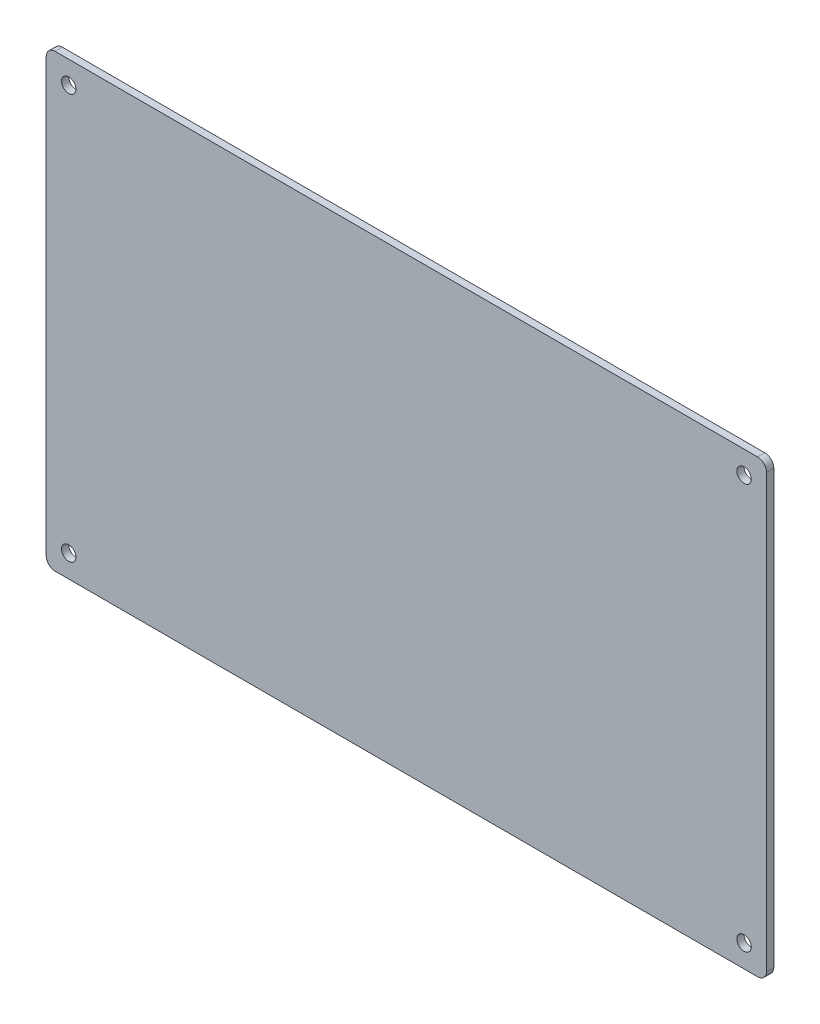
ISO-10303-21;
HEADER;
FILE_DESCRIPTION(('STEP AP214'),'2;1');
FILE_NAME('part.step','',(''),(''),'','','');
FILE_SCHEMA(('AUTOMOTIVE_DESIGN { 1 0 10303 214 1 1 1 1 }'));
ENDSEC;
DATA;
#1=APPLICATION_CONTEXT('core data for automotive mechanical design processes');
#2=APPLICATION_PROTOCOL_DEFINITION('international standard','automotive_design',2000,#1);
#3=PRODUCT_CONTEXT('',#1,'mechanical');
#4=PRODUCT('Part','Part','',(#3));
#5=PRODUCT_RELATED_PRODUCT_CATEGORY('part','',(#4));
#6=PRODUCT_DEFINITION_FORMATION('','',#4);
#7=PRODUCT_DEFINITION_CONTEXT('part definition',#1,'design');
#8=PRODUCT_DEFINITION('design','',#6,#7);
#9=PRODUCT_DEFINITION_SHAPE('','',#8);
#10=(LENGTH_UNIT() NAMED_UNIT(*) SI_UNIT(.MILLI.,.METRE.));
#11=(NAMED_UNIT(*) PLANE_ANGLE_UNIT() SI_UNIT($,.RADIAN.));
#12=(NAMED_UNIT(*) SI_UNIT($,.STERADIAN.) SOLID_ANGLE_UNIT());
#13=UNCERTAINTY_MEASURE_WITH_UNIT(LENGTH_MEASURE(1.E-05),#10,'distance_accuracy_value','');
#14=(GEOMETRIC_REPRESENTATION_CONTEXT(3) GLOBAL_UNCERTAINTY_ASSIGNED_CONTEXT((#13)) GLOBAL_UNIT_ASSIGNED_CONTEXT((#10,
#11,#12)) REPRESENTATION_CONTEXT('',''));
#15=CARTESIAN_POINT('',(0.,0.,0.));
#16=DIRECTION('',(0.,0.,1.));
#17=DIRECTION('',(1.,0.,0.));
#18=AXIS2_PLACEMENT_3D('',#15,#16,#17);
#19=CARTESIAN_POINT('',(-80.,-50.,1.6));
#20=DIRECTION('',(1.,0.,0.));
#21=DIRECTION('',(0.,0.,-1.));
#22=AXIS2_PLACEMENT_3D('',#19,#20,#21);
#23=PLANE('',#22);
#24=DIRECTION('',(0.,-1.,0.));
#25=VECTOR('',#24,1.);
#26=CARTESIAN_POINT('',(-80.,-50.,1.6));
#27=LINE('',#26,#25);
#28=CARTESIAN_POINT('',(-80.,48.,1.6));
#29=VERTEX_POINT('',#28);
#30=CARTESIAN_POINT('',(-80.,-48.,1.6));
#31=VERTEX_POINT('',#30);
#32=EDGE_CURVE('E124',#29,#31,#27,.T.);
#33=ORIENTED_EDGE('',*,*,#32,.F.);
#34=DIRECTION('',(0.,0.,-1.));
#35=VECTOR('',#34,1.);
#36=CARTESIAN_POINT('',(-80.,48.,1.6));
#37=LINE('',#36,#35);
#38=CARTESIAN_POINT('',(-80.,48.,0.));
#39=VERTEX_POINT('',#38);
#40=EDGE_CURVE('E109',#29,#39,#37,.T.);
#41=ORIENTED_EDGE('',*,*,#40,.T.);
#42=DIRECTION('',(0.,-1.,0.));
#43=VECTOR('',#42,1.);
#44=CARTESIAN_POINT('',(-80.,-50.,0.));
#45=LINE('',#44,#43);
#46=CARTESIAN_POINT('',(-80.,-48.,0.));
#47=VERTEX_POINT('',#46);
#48=EDGE_CURVE('E121',#39,#47,#45,.T.);
#49=ORIENTED_EDGE('',*,*,#48,.T.);
#50=DIRECTION('',(0.,0.,-1.));
#51=VECTOR('',#50,1.);
#52=CARTESIAN_POINT('',(-80.,-48.,1.6));
#53=LINE('',#52,#51);
#54=EDGE_CURVE('E126',#47,#31,#53,.F.);
#55=ORIENTED_EDGE('',*,*,#54,.T.);
#56=EDGE_LOOP('',(#33,#41,#49,#55));
#57=FACE_BOUND('',#56,.T.);
#58=ADVANCED_FACE('F37',(#57),#23,.F.);
#59=CARTESIAN_POINT('',(80.,-50.,1.6));
#60=DIRECTION('',(0.,1.,0.));
#61=DIRECTION('',(-1.,0.,0.));
#62=AXIS2_PLACEMENT_3D('',#59,#60,#61);
#63=PLANE('',#62);
#64=DIRECTION('',(1.,0.,0.));
#65=VECTOR('',#64,1.);
#66=CARTESIAN_POINT('',(80.,-50.,1.6));
#67=LINE('',#66,#65);
#68=CARTESIAN_POINT('',(-78.,-50.,1.6));
#69=VERTEX_POINT('',#68);
#70=CARTESIAN_POINT('',(78.,-50.,1.6));
#71=VERTEX_POINT('',#70);
#72=EDGE_CURVE('E184',#69,#71,#67,.T.);
#73=ORIENTED_EDGE('',*,*,#72,.F.);
#74=DIRECTION('',(0.,0.,-1.));
#75=VECTOR('',#74,1.);
#76=CARTESIAN_POINT('',(-78.,-50.,1.6));
#77=LINE('',#76,#75);
#78=CARTESIAN_POINT('',(-78.,-50.,0.));
#79=VERTEX_POINT('',#78);
#80=EDGE_CURVE('E163',#69,#79,#77,.T.);
#81=ORIENTED_EDGE('',*,*,#80,.T.);
#82=DIRECTION('',(1.,0.,0.));
#83=VECTOR('',#82,1.);
#84=CARTESIAN_POINT('',(80.,-50.,0.));
#85=LINE('',#84,#83);
#86=CARTESIAN_POINT('',(78.,-50.,0.));
#87=VERTEX_POINT('',#86);
#88=EDGE_CURVE('E130',#79,#87,#85,.T.);
#89=ORIENTED_EDGE('',*,*,#88,.T.);
#90=DIRECTION('',(0.,0.,-1.));
#91=VECTOR('',#90,1.);
#92=CARTESIAN_POINT('',(78.,-50.,1.6));
#93=LINE('',#92,#91);
#94=EDGE_CURVE('E161',#87,#71,#93,.F.);
#95=ORIENTED_EDGE('',*,*,#94,.T.);
#96=EDGE_LOOP('',(#73,#81,#89,#95));
#97=FACE_BOUND('',#96,.T.);
#98=ADVANCED_FACE('F202',(#97),#63,.F.);
#99=CARTESIAN_POINT('',(80.,-50.,1.6));
#100=DIRECTION('',(-1.,0.,0.));
#101=DIRECTION('',(0.,0.,1.));
#102=AXIS2_PLACEMENT_3D('',#99,#100,#101);
#103=PLANE('',#102);
#104=DIRECTION('',(0.,1.,0.));
#105=VECTOR('',#104,1.);
#106=CARTESIAN_POINT('',(80.,-50.,1.6));
#107=LINE('',#106,#105);
#108=CARTESIAN_POINT('',(80.,-48.,1.6));
#109=VERTEX_POINT('',#108);
#110=CARTESIAN_POINT('',(80.,48.,1.6));
#111=VERTEX_POINT('',#110);
#112=EDGE_CURVE('E185',#109,#111,#107,.T.);
#113=ORIENTED_EDGE('',*,*,#112,.F.);
#114=DIRECTION('',(0.,0.,-1.));
#115=VECTOR('',#114,1.);
#116=CARTESIAN_POINT('',(80.,-48.,1.6));
#117=LINE('',#116,#115);
#118=CARTESIAN_POINT('',(80.,-48.,0.));
#119=VERTEX_POINT('',#118);
#120=EDGE_CURVE('E11',#109,#119,#117,.T.);
#121=ORIENTED_EDGE('',*,*,#120,.T.);
#122=DIRECTION('',(0.,1.,0.));
#123=VECTOR('',#122,1.);
#124=CARTESIAN_POINT('',(80.,-50.,0.));
#125=LINE('',#124,#123);
#126=CARTESIAN_POINT('',(80.,48.,0.));
#127=VERTEX_POINT('',#126);
#128=EDGE_CURVE('E134',#119,#127,#125,.T.);
#129=ORIENTED_EDGE('',*,*,#128,.T.);
#130=DIRECTION('',(0.,0.,-1.));
#131=VECTOR('',#130,1.);
#132=CARTESIAN_POINT('',(80.,48.,1.6));
#133=LINE('',#132,#131);
#134=EDGE_CURVE('E46',#127,#111,#133,.F.);
#135=ORIENTED_EDGE('',*,*,#134,.T.);
#136=EDGE_LOOP('',(#113,#121,#129,#135));
#137=FACE_BOUND('',#136,.T.);
#138=ADVANCED_FACE('F195',(#137),#103,.F.);
#139=CARTESIAN_POINT('',(80.,50.,1.6));
#140=DIRECTION('',(0.,-1.,0.));
#141=DIRECTION('',(1.,0.,0.));
#142=AXIS2_PLACEMENT_3D('',#139,#140,#141);
#143=PLANE('',#142);
#144=DIRECTION('',(-1.,0.,0.));
#145=VECTOR('',#144,1.);
#146=CARTESIAN_POINT('',(80.,50.,0.));
#147=LINE('',#146,#145);
#148=CARTESIAN_POINT('',(78.,50.,0.));
#149=VERTEX_POINT('',#148);
#150=CARTESIAN_POINT('',(-78.,50.,0.));
#151=VERTEX_POINT('',#150);
#152=EDGE_CURVE('E144',#149,#151,#147,.T.);
#153=ORIENTED_EDGE('',*,*,#152,.T.);
#154=DIRECTION('',(0.,0.,-1.));
#155=VECTOR('',#154,1.);
#156=CARTESIAN_POINT('',(-78.,50.,1.6));
#157=LINE('',#156,#155);
#158=CARTESIAN_POINT('',(-78.,50.,1.6));
#159=VERTEX_POINT('',#158);
#160=EDGE_CURVE('E110',#151,#159,#157,.F.);
#161=ORIENTED_EDGE('',*,*,#160,.T.);
#162=DIRECTION('',(-1.,0.,0.));
#163=VECTOR('',#162,1.);
#164=CARTESIAN_POINT('',(80.,50.,1.6));
#165=LINE('',#164,#163);
#166=CARTESIAN_POINT('',(78.,50.,1.6));
#167=VERTEX_POINT('',#166);
#168=EDGE_CURVE('E140',#167,#159,#165,.T.);
#169=ORIENTED_EDGE('',*,*,#168,.F.);
#170=DIRECTION('',(0.,0.,-1.));
#171=VECTOR('',#170,1.);
#172=CARTESIAN_POINT('',(78.,50.,1.6));
#173=LINE('',#172,#171);
#174=EDGE_CURVE('E115',#167,#149,#173,.T.);
#175=ORIENTED_EDGE('',*,*,#174,.T.);
#176=EDGE_LOOP('',(#153,#161,#169,#175));
#177=FACE_BOUND('',#176,.T.);
#178=ADVANCED_FACE('F192',(#177),#143,.F.);
#179=CARTESIAN_POINT('',(0.,0.,1.6));
#180=DIRECTION('',(0.,0.,1.));
#181=DIRECTION('',(1.,0.,0.));
#182=AXIS2_PLACEMENT_3D('',#179,#180,#181);
#183=PLANE('',#182);
#184=CARTESIAN_POINT('',(75.,45.,1.6));
#185=DIRECTION('',(0.,0.,1.));
#186=DIRECTION('',(1.,0.,0.));
#187=AXIS2_PLACEMENT_3D('',#184,#185,#186);
#188=CIRCLE('',#187,1.59999999999999);
#189=CARTESIAN_POINT('',(76.6,45.,1.6));
#190=VERTEX_POINT('',#189);
#191=EDGE_CURVE('E250',#190,#190,#188,.T.);
#192=ORIENTED_EDGE('',*,*,#191,.F.);
#193=EDGE_LOOP('',(#192));
#194=FACE_BOUND('',#193,.T.);
#195=CARTESIAN_POINT('',(-75.,-45.,1.6));
#196=DIRECTION('',(0.,0.,1.));
#197=DIRECTION('',(1.,0.,0.));
#198=AXIS2_PLACEMENT_3D('',#195,#196,#197);
#199=CIRCLE('',#198,1.59999999999999);
#200=CARTESIAN_POINT('',(-73.4,-45.,1.6));
#201=VERTEX_POINT('',#200);
#202=EDGE_CURVE('E179',#201,#201,#199,.T.);
#203=ORIENTED_EDGE('',*,*,#202,.F.);
#204=EDGE_LOOP('',(#203));
#205=FACE_BOUND('',#204,.T.);
#206=CARTESIAN_POINT('',(-75.,45.,1.6));
#207=DIRECTION('',(0.,0.,1.));
#208=DIRECTION('',(1.,0.,0.));
#209=AXIS2_PLACEMENT_3D('',#206,#207,#208);
#210=CIRCLE('',#209,1.59999999999999);
#211=CARTESIAN_POINT('',(-73.4,45.,1.6));
#212=VERTEX_POINT('',#211);
#213=EDGE_CURVE('E168',#212,#212,#210,.T.);
#214=ORIENTED_EDGE('',*,*,#213,.F.);
#215=EDGE_LOOP('',(#214));
#216=FACE_BOUND('',#215,.T.);
#217=CARTESIAN_POINT('',(75.,-45.,1.6));
#218=DIRECTION('',(0.,0.,1.));
#219=DIRECTION('',(1.,0.,0.));
#220=AXIS2_PLACEMENT_3D('',#217,#218,#219);
#221=CIRCLE('',#220,1.59999999999999);
#222=CARTESIAN_POINT('',(76.6,-45.,1.6));
#223=VERTEX_POINT('',#222);
#224=EDGE_CURVE('E137',#223,#223,#221,.T.);
#225=ORIENTED_EDGE('',*,*,#224,.F.);
#226=EDGE_LOOP('',(#225));
#227=FACE_BOUND('',#226,.T.);
#228=ORIENTED_EDGE('',*,*,#168,.T.);
#229=CARTESIAN_POINT('',(-78.,48.,1.6));
#230=DIRECTION('',(0.,0.,1.));
#231=DIRECTION('',(1.,0.,0.));
#232=AXIS2_PLACEMENT_3D('',#229,#230,#231);
#233=CIRCLE('',#232,2.);
#234=EDGE_CURVE('E159',#159,#29,#233,.T.);
#235=ORIENTED_EDGE('',*,*,#234,.T.);
#236=ORIENTED_EDGE('',*,*,#32,.T.);
#237=CARTESIAN_POINT('',(-78.,-48.,1.6));
#238=DIRECTION('',(0.,0.,1.));
#239=DIRECTION('',(1.,0.,0.));
#240=AXIS2_PLACEMENT_3D('',#237,#238,#239);
#241=CIRCLE('',#240,2.);
#242=EDGE_CURVE('E157',#31,#69,#241,.T.);
#243=ORIENTED_EDGE('',*,*,#242,.T.);
#244=ORIENTED_EDGE('',*,*,#72,.T.);
#245=CARTESIAN_POINT('',(78.,-48.,1.6));
#246=DIRECTION('',(0.,0.,1.));
#247=DIRECTION('',(1.,0.,0.));
#248=AXIS2_PLACEMENT_3D('',#245,#246,#247);
#249=CIRCLE('',#248,2.);
#250=EDGE_CURVE('E60',#71,#109,#249,.T.);
#251=ORIENTED_EDGE('',*,*,#250,.T.);
#252=ORIENTED_EDGE('',*,*,#112,.T.);
#253=CARTESIAN_POINT('',(78.,48.,1.6));
#254=DIRECTION('',(0.,0.,1.));
#255=DIRECTION('',(1.,0.,0.));
#256=AXIS2_PLACEMENT_3D('',#253,#254,#255);
#257=CIRCLE('',#256,2.);
#258=EDGE_CURVE('E154',#111,#167,#257,.T.);
#259=ORIENTED_EDGE('',*,*,#258,.T.);
#260=EDGE_LOOP('',(#228,#235,#236,#243,#244,#251,#252,#259));
#261=FACE_BOUND('',#260,.T.);
#262=ADVANCED_FACE('F189',(#194,#205,#216,#227,#261),#183,.T.);
#263=CARTESIAN_POINT('',(0.,0.,0.));
#264=DIRECTION('',(0.,0.,1.));
#265=DIRECTION('',(1.,0.,0.));
#266=AXIS2_PLACEMENT_3D('',#263,#264,#265);
#267=PLANE('',#266);
#268=CARTESIAN_POINT('',(75.,45.,0.));
#269=DIRECTION('',(0.,0.,1.));
#270=DIRECTION('',(1.,0.,0.));
#271=AXIS2_PLACEMENT_3D('',#268,#269,#270);
#272=CIRCLE('',#271,1.59999999999999);
#273=CARTESIAN_POINT('',(76.6,45.,0.));
#274=VERTEX_POINT('',#273);
#275=EDGE_CURVE('E41',#274,#274,#272,.T.);
#276=ORIENTED_EDGE('',*,*,#275,.T.);
#277=EDGE_LOOP('',(#276));
#278=FACE_BOUND('',#277,.T.);
#279=CARTESIAN_POINT('',(-75.,-45.,0.));
#280=DIRECTION('',(0.,0.,1.));
#281=DIRECTION('',(1.,0.,0.));
#282=AXIS2_PLACEMENT_3D('',#279,#280,#281);
#283=CIRCLE('',#282,1.59999999999999);
#284=CARTESIAN_POINT('',(-73.4,-45.,0.));
#285=VERTEX_POINT('',#284);
#286=EDGE_CURVE('E174',#285,#285,#283,.T.);
#287=ORIENTED_EDGE('',*,*,#286,.T.);
#288=EDGE_LOOP('',(#287));
#289=FACE_BOUND('',#288,.T.);
#290=CARTESIAN_POINT('',(-75.,45.,0.));
#291=DIRECTION('',(0.,0.,1.));
#292=DIRECTION('',(1.,0.,0.));
#293=AXIS2_PLACEMENT_3D('',#290,#291,#292);
#294=CIRCLE('',#293,1.59999999999999);
#295=CARTESIAN_POINT('',(-73.4,45.,0.));
#296=VERTEX_POINT('',#295);
#297=EDGE_CURVE('E166',#296,#296,#294,.T.);
#298=ORIENTED_EDGE('',*,*,#297,.T.);
#299=EDGE_LOOP('',(#298));
#300=FACE_BOUND('',#299,.T.);
#301=CARTESIAN_POINT('',(75.,-45.,0.));
#302=DIRECTION('',(0.,0.,1.));
#303=DIRECTION('',(1.,0.,0.));
#304=AXIS2_PLACEMENT_3D('',#301,#302,#303);
#305=CIRCLE('',#304,1.59999999999999);
#306=CARTESIAN_POINT('',(76.6,-45.,0.));
#307=VERTEX_POINT('',#306);
#308=EDGE_CURVE('E131',#307,#307,#305,.T.);
#309=ORIENTED_EDGE('',*,*,#308,.T.);
#310=EDGE_LOOP('',(#309));
#311=FACE_BOUND('',#310,.T.);
#312=ORIENTED_EDGE('',*,*,#48,.F.);
#313=CARTESIAN_POINT('',(-78.,48.,0.));
#314=DIRECTION('',(0.,0.,1.));
#315=DIRECTION('',(1.,0.,0.));
#316=AXIS2_PLACEMENT_3D('',#313,#314,#315);
#317=CIRCLE('',#316,2.);
#318=EDGE_CURVE('E105',#39,#151,#317,.F.);
#319=ORIENTED_EDGE('',*,*,#318,.T.);
#320=ORIENTED_EDGE('',*,*,#152,.F.);
#321=CARTESIAN_POINT('',(78.,48.,0.));
#322=DIRECTION('',(0.,0.,1.));
#323=DIRECTION('',(1.,0.,0.));
#324=AXIS2_PLACEMENT_3D('',#321,#322,#323);
#325=CIRCLE('',#324,2.);
#326=EDGE_CURVE('E125',#149,#127,#325,.F.);
#327=ORIENTED_EDGE('',*,*,#326,.T.);
#328=ORIENTED_EDGE('',*,*,#128,.F.);
#329=CARTESIAN_POINT('',(78.,-48.,0.));
#330=DIRECTION('',(0.,0.,1.));
#331=DIRECTION('',(1.,0.,0.));
#332=AXIS2_PLACEMENT_3D('',#329,#330,#331);
#333=CIRCLE('',#332,2.);
#334=EDGE_CURVE('E148',#119,#87,#333,.F.);
#335=ORIENTED_EDGE('',*,*,#334,.T.);
#336=ORIENTED_EDGE('',*,*,#88,.F.);
#337=CARTESIAN_POINT('',(-78.,-48.,0.));
#338=DIRECTION('',(0.,0.,1.));
#339=DIRECTION('',(1.,0.,0.));
#340=AXIS2_PLACEMENT_3D('',#337,#338,#339);
#341=CIRCLE('',#340,2.);
#342=EDGE_CURVE('E116',#79,#47,#341,.F.);
#343=ORIENTED_EDGE('',*,*,#342,.T.);
#344=EDGE_LOOP('',(#312,#319,#320,#327,#328,#335,#336,#343));
#345=FACE_BOUND('',#344,.T.);
#346=ADVANCED_FACE('F128',(#278,#289,#300,#311,#345),#267,.F.);
#347=CARTESIAN_POINT('',(-78.,48.,1.6));
#348=DIRECTION('',(0.,0.,-1.));
#349=DIRECTION('',(-1.,0.,0.));
#350=AXIS2_PLACEMENT_3D('',#347,#348,#349);
#351=CYLINDRICAL_SURFACE('',#350,2.);
#352=ORIENTED_EDGE('',*,*,#234,.F.);
#353=ORIENTED_EDGE('',*,*,#160,.F.);
#354=ORIENTED_EDGE('',*,*,#318,.F.);
#355=ORIENTED_EDGE('',*,*,#40,.F.);
#356=EDGE_LOOP('',(#352,#353,#354,#355));
#357=FACE_BOUND('',#356,.T.);
#358=ADVANCED_FACE('F108',(#357),#351,.T.);
#359=CARTESIAN_POINT('',(-78.,-48.,1.6));
#360=DIRECTION('',(0.,0.,-1.));
#361=DIRECTION('',(-1.,0.,0.));
#362=AXIS2_PLACEMENT_3D('',#359,#360,#361);
#363=CYLINDRICAL_SURFACE('',#362,2.);
#364=ORIENTED_EDGE('',*,*,#242,.F.);
#365=ORIENTED_EDGE('',*,*,#54,.F.);
#366=ORIENTED_EDGE('',*,*,#342,.F.);
#367=ORIENTED_EDGE('',*,*,#80,.F.);
#368=EDGE_LOOP('',(#364,#365,#366,#367));
#369=FACE_BOUND('',#368,.T.);
#370=ADVANCED_FACE('F206',(#369),#363,.T.);
#371=CARTESIAN_POINT('',(78.,-48.,1.6));
#372=DIRECTION('',(0.,0.,-1.));
#373=DIRECTION('',(-1.,0.,0.));
#374=AXIS2_PLACEMENT_3D('',#371,#372,#373);
#375=CYLINDRICAL_SURFACE('',#374,2.);
#376=ORIENTED_EDGE('',*,*,#250,.F.);
#377=ORIENTED_EDGE('',*,*,#94,.F.);
#378=ORIENTED_EDGE('',*,*,#334,.F.);
#379=ORIENTED_EDGE('',*,*,#120,.F.);
#380=EDGE_LOOP('',(#376,#377,#378,#379));
#381=FACE_BOUND('',#380,.T.);
#382=ADVANCED_FACE('F198',(#381),#375,.T.);
#383=CARTESIAN_POINT('',(78.,48.,1.6));
#384=DIRECTION('',(0.,0.,-1.));
#385=DIRECTION('',(-1.,0.,0.));
#386=AXIS2_PLACEMENT_3D('',#383,#384,#385);
#387=CYLINDRICAL_SURFACE('',#386,2.);
#388=ORIENTED_EDGE('',*,*,#258,.F.);
#389=ORIENTED_EDGE('',*,*,#134,.F.);
#390=ORIENTED_EDGE('',*,*,#326,.F.);
#391=ORIENTED_EDGE('',*,*,#174,.F.);
#392=EDGE_LOOP('',(#388,#389,#390,#391));
#393=FACE_BOUND('',#392,.T.);
#394=ADVANCED_FACE('F39',(#393),#387,.T.);
#395=CARTESIAN_POINT('',(75.,-45.,1.6));
#396=DIRECTION('',(0.,0.,1.));
#397=DIRECTION('',(1.,0.,0.));
#398=AXIS2_PLACEMENT_3D('',#395,#396,#397);
#399=CYLINDRICAL_SURFACE('',#398,1.59999999999999);
#400=ORIENTED_EDGE('',*,*,#224,.T.);
#401=EDGE_LOOP('',(#400));
#402=FACE_BOUND('',#401,.T.);
#403=ORIENTED_EDGE('',*,*,#308,.F.);
#404=EDGE_LOOP('',(#403));
#405=FACE_BOUND('',#404,.T.);
#406=ADVANCED_FACE('F231',(#402,#405),#399,.F.);
#407=CARTESIAN_POINT('',(-75.,45.,1.6));
#408=DIRECTION('',(0.,0.,1.));
#409=DIRECTION('',(1.,0.,0.));
#410=AXIS2_PLACEMENT_3D('',#407,#408,#409);
#411=CYLINDRICAL_SURFACE('',#410,1.59999999999999);
#412=ORIENTED_EDGE('',*,*,#213,.T.);
#413=EDGE_LOOP('',(#412));
#414=FACE_BOUND('',#413,.T.);
#415=ORIENTED_EDGE('',*,*,#297,.F.);
#416=EDGE_LOOP('',(#415));
#417=FACE_BOUND('',#416,.T.);
#418=ADVANCED_FACE('F234',(#414,#417),#411,.F.);
#419=CARTESIAN_POINT('',(-75.,-45.,1.6));
#420=DIRECTION('',(0.,0.,1.));
#421=DIRECTION('',(1.,0.,0.));
#422=AXIS2_PLACEMENT_3D('',#419,#420,#421);
#423=CYLINDRICAL_SURFACE('',#422,1.59999999999999);
#424=ORIENTED_EDGE('',*,*,#202,.T.);
#425=EDGE_LOOP('',(#424));
#426=FACE_BOUND('',#425,.T.);
#427=ORIENTED_EDGE('',*,*,#286,.F.);
#428=EDGE_LOOP('',(#427));
#429=FACE_BOUND('',#428,.T.);
#430=ADVANCED_FACE('F238',(#426,#429),#423,.F.);
#431=CARTESIAN_POINT('',(75.,45.,1.6));
#432=DIRECTION('',(0.,0.,1.));
#433=DIRECTION('',(1.,0.,0.));
#434=AXIS2_PLACEMENT_3D('',#431,#432,#433);
#435=CYLINDRICAL_SURFACE('',#434,1.59999999999999);
#436=ORIENTED_EDGE('',*,*,#191,.T.);
#437=EDGE_LOOP('',(#436));
#438=FACE_BOUND('',#437,.T.);
#439=ORIENTED_EDGE('',*,*,#275,.F.);
#440=EDGE_LOOP('',(#439));
#441=FACE_BOUND('',#440,.T.);
#442=ADVANCED_FACE('F241',(#438,#441),#435,.F.);
#443=CLOSED_SHELL('',(#58,#98,#138,#178,#262,#346,#358,#370,#382,#394,#406,#418,#430,#442));
#444=MANIFOLD_SOLID_BREP('B2',#443);
#445=ADVANCED_BREP_SHAPE_REPRESENTATION('',(#18,#444),#14);
#446=SHAPE_DEFINITION_REPRESENTATION(#9,#445);
ENDSEC;
END-ISO-10303-21;
